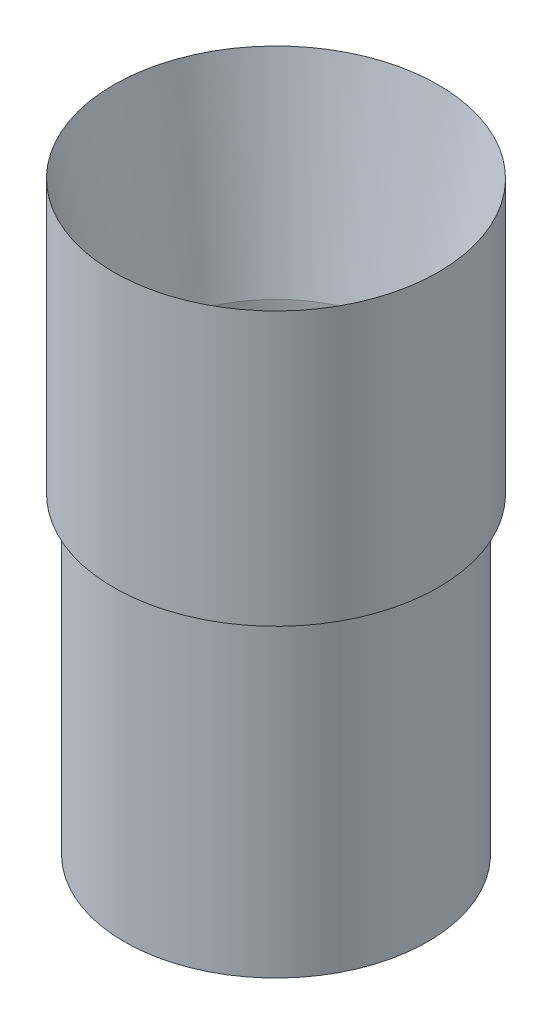
ISO-10303-21;
HEADER;
FILE_DESCRIPTION(('STEP AP214'),'2;1');
FILE_NAME('part.step','',(''),(''),'','','');
FILE_SCHEMA(('AUTOMOTIVE_DESIGN { 1 0 10303 214 1 1 1 1 }'));
ENDSEC;
DATA;
#1=APPLICATION_CONTEXT('core data for automotive mechanical design processes');
#2=APPLICATION_PROTOCOL_DEFINITION('international standard','automotive_design',2000,#1);
#3=PRODUCT_CONTEXT('',#1,'mechanical');
#4=PRODUCT('Part','Part','',(#3));
#5=PRODUCT_RELATED_PRODUCT_CATEGORY('part','',(#4));
#6=PRODUCT_DEFINITION_FORMATION('','',#4);
#7=PRODUCT_DEFINITION_CONTEXT('part definition',#1,'design');
#8=PRODUCT_DEFINITION('design','',#6,#7);
#9=PRODUCT_DEFINITION_SHAPE('','',#8);
#10=(LENGTH_UNIT() NAMED_UNIT(*) SI_UNIT(.MILLI.,.METRE.));
#11=(NAMED_UNIT(*) PLANE_ANGLE_UNIT() SI_UNIT($,.RADIAN.));
#12=(NAMED_UNIT(*) SI_UNIT($,.STERADIAN.) SOLID_ANGLE_UNIT());
#13=UNCERTAINTY_MEASURE_WITH_UNIT(LENGTH_MEASURE(1.E-05),#10,'distance_accuracy_value','');
#14=(GEOMETRIC_REPRESENTATION_CONTEXT(3) GLOBAL_UNCERTAINTY_ASSIGNED_CONTEXT((#13)) GLOBAL_UNIT_ASSIGNED_CONTEXT((#10,
#11,#12)) REPRESENTATION_CONTEXT('',''));
#15=CARTESIAN_POINT('',(0.,0.,0.));
#16=DIRECTION('',(0.,0.,1.));
#17=DIRECTION('',(1.,0.,0.));
#18=AXIS2_PLACEMENT_3D('',#15,#16,#17);
#19=CARTESIAN_POINT('',(49.3776,245.641517485021,0.));
#20=DIRECTION('',(0.,1.,0.));
#21=DIRECTION('',(-1.,0.,0.));
#22=AXIS2_PLACEMENT_3D('',#19,#20,#21);
#23=CYLINDRICAL_SURFACE('',#22,49.3776);
#24=CARTESIAN_POINT('',(49.3776,0.,0.));
#25=DIRECTION('',(0.,1.,0.));
#26=DIRECTION('',(-1.,0.,0.));
#27=AXIS2_PLACEMENT_3D('',#24,#25,#26);
#28=CIRCLE('',#27,49.3776);
#29=CARTESIAN_POINT('',(0.,0.,0.));
#30=VERTEX_POINT('',#29);
#31=EDGE_CURVE('E76',#30,#30,#28,.T.);
#32=ORIENTED_EDGE('',*,*,#31,.T.);
#33=EDGE_LOOP('',(#32));
#34=FACE_BOUND('',#33,.T.);
#35=CARTESIAN_POINT('',(49.3776,101.6,0.));
#36=DIRECTION('',(0.,1.,0.));
#37=DIRECTION('',(-1.,0.,0.));
#38=AXIS2_PLACEMENT_3D('',#35,#36,#37);
#39=CIRCLE('',#38,49.3776);
#40=CARTESIAN_POINT('',(0.,101.6,0.));
#41=VERTEX_POINT('',#40);
#42=EDGE_CURVE('E10',#41,#41,#39,.T.);
#43=ORIENTED_EDGE('',*,*,#42,.F.);
#44=EDGE_LOOP('',(#43));
#45=FACE_BOUND('',#44,.T.);
#46=ADVANCED_FACE('F41',(#34,#45),#23,.T.);
#47=CARTESIAN_POINT('',(-3.4544,101.6,0.));
#48=DIRECTION('',(0.,-1.,0.));
#49=DIRECTION('',(1.,0.,0.));
#50=AXIS2_PLACEMENT_3D('',#47,#48,#49);
#51=PLANE('',#50);
#52=ORIENTED_EDGE('',*,*,#42,.T.);
#53=EDGE_LOOP('',(#52));
#54=FACE_BOUND('',#53,.T.);
#55=CARTESIAN_POINT('',(49.3776,101.6,0.));
#56=DIRECTION('',(0.,1.,0.));
#57=DIRECTION('',(-1.,0.,0.));
#58=AXIS2_PLACEMENT_3D('',#55,#56,#57);
#59=CIRCLE('',#58,52.832);
#60=CARTESIAN_POINT('',(-3.4544,101.6,0.));
#61=VERTEX_POINT('',#60);
#62=EDGE_CURVE('E48',#61,#61,#59,.T.);
#63=ORIENTED_EDGE('',*,*,#62,.F.);
#64=EDGE_LOOP('',(#63));
#65=FACE_BOUND('',#64,.T.);
#66=ADVANCED_FACE('F95',(#54,#65),#51,.T.);
#67=CARTESIAN_POINT('',(49.3776,245.641517485021,0.));
#68=DIRECTION('',(0.,1.,0.));
#69=DIRECTION('',(-1.,0.,0.));
#70=AXIS2_PLACEMENT_3D('',#67,#68,#69);
#71=CYLINDRICAL_SURFACE('',#70,52.832);
#72=ORIENTED_EDGE('',*,*,#62,.T.);
#73=EDGE_LOOP('',(#72));
#74=FACE_BOUND('',#73,.T.);
#75=CARTESIAN_POINT('',(49.3776,190.5,0.));
#76=DIRECTION('',(0.,1.,0.));
#77=DIRECTION('',(-1.,0.,0.));
#78=AXIS2_PLACEMENT_3D('',#75,#76,#77);
#79=CIRCLE('',#78,52.832);
#80=CARTESIAN_POINT('',(-3.45440000000001,190.5,0.));
#81=VERTEX_POINT('',#80);
#82=EDGE_CURVE('E53',#81,#81,#79,.T.);
#83=ORIENTED_EDGE('',*,*,#82,.F.);
#84=EDGE_LOOP('',(#83));
#85=FACE_BOUND('',#84,.T.);
#86=ADVANCED_FACE('F99',(#74,#85),#71,.T.);
#87=CARTESIAN_POINT('',(49.3776,127.,0.));
#88=DIRECTION('',(0.,1.,0.));
#89=DIRECTION('',(-1.,0.,0.));
#90=AXIS2_PLACEMENT_3D('',#87,#88,#89);
#91=CONICAL_SURFACE('',#90,41.6352367250129,0.174532925199426);
#92=ORIENTED_EDGE('',*,*,#82,.T.);
#93=EDGE_LOOP('',(#92));
#94=FACE_BOUND('',#93,.T.);
#95=CARTESIAN_POINT('',(49.3776,127.,0.));
#96=DIRECTION('',(0.,1.,0.));
#97=DIRECTION('',(-1.,0.,0.));
#98=AXIS2_PLACEMENT_3D('',#95,#96,#97);
#99=CIRCLE('',#98,41.6352367250129);
#100=CARTESIAN_POINT('',(7.74236327498708,127.,0.));
#101=VERTEX_POINT('',#100);
#102=EDGE_CURVE('E58',#101,#101,#99,.T.);
#103=ORIENTED_EDGE('',*,*,#102,.F.);
#104=EDGE_LOOP('',(#103));
#105=FACE_BOUND('',#104,.T.);
#106=ADVANCED_FACE('F103',(#94,#105),#91,.F.);
#107=CARTESIAN_POINT('',(49.3776,245.641517485021,0.));
#108=DIRECTION('',(0.,1.,0.));
#109=DIRECTION('',(-1.,0.,0.));
#110=AXIS2_PLACEMENT_3D('',#107,#108,#109);
#111=CYLINDRICAL_SURFACE('',#110,41.6352367250129);
#112=ORIENTED_EDGE('',*,*,#102,.T.);
#113=EDGE_LOOP('',(#112));
#114=FACE_BOUND('',#113,.T.);
#115=CARTESIAN_POINT('',(49.3776,101.6,0.));
#116=DIRECTION('',(0.,1.,0.));
#117=DIRECTION('',(-1.,0.,0.));
#118=AXIS2_PLACEMENT_3D('',#115,#116,#117);
#119=CIRCLE('',#118,41.6352367250129);
#120=CARTESIAN_POINT('',(7.74236327498708,101.6,0.));
#121=VERTEX_POINT('',#120);
#122=EDGE_CURVE('E64',#121,#121,#119,.T.);
#123=ORIENTED_EDGE('',*,*,#122,.F.);
#124=EDGE_LOOP('',(#123));
#125=FACE_BOUND('',#124,.T.);
#126=ADVANCED_FACE('F109',(#114,#125),#111,.F.);
#127=CARTESIAN_POINT('',(7.74236327498708,101.6,0.));
#128=DIRECTION('',(0.,-1.,0.));
#129=DIRECTION('',(1.,0.,0.));
#130=AXIS2_PLACEMENT_3D('',#127,#128,#129);
#131=PLANE('',#130);
#132=ORIENTED_EDGE('',*,*,#122,.T.);
#133=EDGE_LOOP('',(#132));
#134=FACE_BOUND('',#133,.T.);
#135=CARTESIAN_POINT('',(49.3776,101.6,0.));
#136=DIRECTION('',(0.,1.,0.));
#137=DIRECTION('',(-1.,0.,0.));
#138=AXIS2_PLACEMENT_3D('',#135,#136,#137);
#139=CIRCLE('',#138,47.3456);
#140=CARTESIAN_POINT('',(2.03199999999999,101.6,0.));
#141=VERTEX_POINT('',#140);
#142=EDGE_CURVE('E68',#141,#141,#139,.T.);
#143=ORIENTED_EDGE('',*,*,#142,.F.);
#144=EDGE_LOOP('',(#143));
#145=FACE_BOUND('',#144,.T.);
#146=ADVANCED_FACE('F91',(#134,#145),#131,.T.);
#147=CARTESIAN_POINT('',(49.3776,245.641517485021,0.));
#148=DIRECTION('',(0.,1.,0.));
#149=DIRECTION('',(-1.,0.,0.));
#150=AXIS2_PLACEMENT_3D('',#147,#148,#149);
#151=CYLINDRICAL_SURFACE('',#150,47.3456);
#152=ORIENTED_EDGE('',*,*,#142,.T.);
#153=EDGE_LOOP('',(#152));
#154=FACE_BOUND('',#153,.T.);
#155=CARTESIAN_POINT('',(49.3776,0.,0.));
#156=DIRECTION('',(0.,1.,0.));
#157=DIRECTION('',(-1.,0.,0.));
#158=AXIS2_PLACEMENT_3D('',#155,#156,#157);
#159=CIRCLE('',#158,47.3456);
#160=CARTESIAN_POINT('',(2.032,0.,0.));
#161=VERTEX_POINT('',#160);
#162=EDGE_CURVE('E72',#161,#161,#159,.T.);
#163=ORIENTED_EDGE('',*,*,#162,.F.);
#164=EDGE_LOOP('',(#163));
#165=FACE_BOUND('',#164,.T.);
#166=ADVANCED_FACE('F85',(#154,#165),#151,.F.);
#167=CARTESIAN_POINT('',(2.032,0.,0.));
#168=DIRECTION('',(0.,-1.,0.));
#169=DIRECTION('',(1.,0.,0.));
#170=AXIS2_PLACEMENT_3D('',#167,#168,#169);
#171=PLANE('',#170);
#172=ORIENTED_EDGE('',*,*,#162,.T.);
#173=EDGE_LOOP('',(#172));
#174=FACE_BOUND('',#173,.T.);
#175=ORIENTED_EDGE('',*,*,#31,.F.);
#176=EDGE_LOOP('',(#175));
#177=FACE_BOUND('',#176,.T.);
#178=ADVANCED_FACE('F83',(#174,#177),#171,.T.);
#179=CLOSED_SHELL('',(#46,#66,#86,#106,#126,#146,#166,#178));
#180=MANIFOLD_SOLID_BREP('B2',#179);
#181=ADVANCED_BREP_SHAPE_REPRESENTATION('',(#18,#180),#14);
#182=SHAPE_DEFINITION_REPRESENTATION(#9,#181);
ENDSEC;
END-ISO-10303-21;
